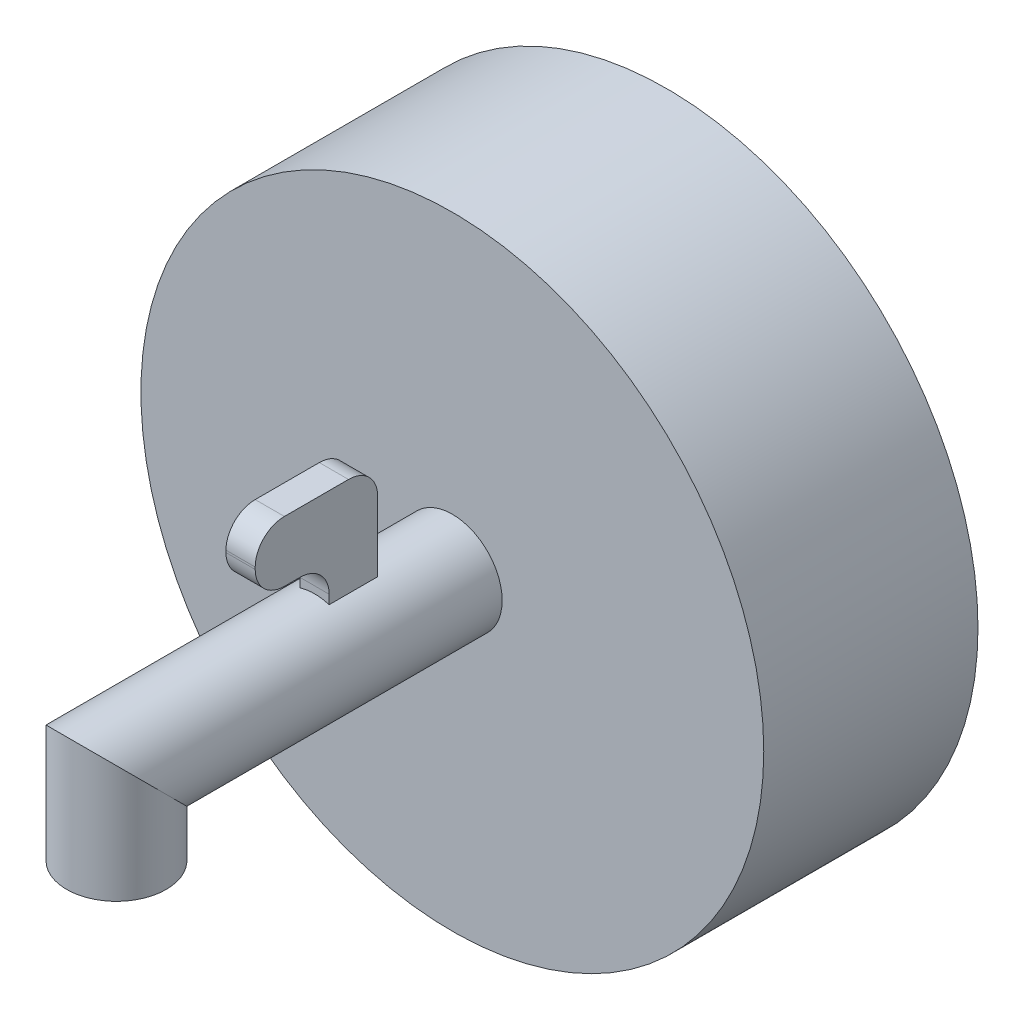
ISO-10303-21;
HEADER;
FILE_DESCRIPTION(('STEP AP214'),'2;1');
FILE_NAME('part.step','',(''),(''),'','','');
FILE_SCHEMA(('AUTOMOTIVE_DESIGN { 1 0 10303 214 1 1 1 1 }'));
ENDSEC;
DATA;
#1=APPLICATION_CONTEXT('core data for automotive mechanical design processes');
#2=APPLICATION_PROTOCOL_DEFINITION('international standard','automotive_design',2000,#1);
#3=PRODUCT_CONTEXT('',#1,'mechanical');
#4=PRODUCT('Part','Part','',(#3));
#5=PRODUCT_RELATED_PRODUCT_CATEGORY('part','',(#4));
#6=PRODUCT_DEFINITION_FORMATION('','',#4);
#7=PRODUCT_DEFINITION_CONTEXT('part definition',#1,'design');
#8=PRODUCT_DEFINITION('design','',#6,#7);
#9=PRODUCT_DEFINITION_SHAPE('','',#8);
#10=(LENGTH_UNIT() NAMED_UNIT(*) SI_UNIT(.MILLI.,.METRE.));
#11=(NAMED_UNIT(*) PLANE_ANGLE_UNIT() SI_UNIT($,.RADIAN.));
#12=(NAMED_UNIT(*) SI_UNIT($,.STERADIAN.) SOLID_ANGLE_UNIT());
#13=UNCERTAINTY_MEASURE_WITH_UNIT(LENGTH_MEASURE(1.E-05),#10,'distance_accuracy_value','');
#14=(GEOMETRIC_REPRESENTATION_CONTEXT(3) GLOBAL_UNCERTAINTY_ASSIGNED_CONTEXT((#13)) GLOBAL_UNIT_ASSIGNED_CONTEXT((#10,
#11,#12)) REPRESENTATION_CONTEXT('',''));
#15=CARTESIAN_POINT('',(0.,0.,0.));
#16=DIRECTION('',(0.,0.,1.));
#17=DIRECTION('',(1.,0.,0.));
#18=AXIS2_PLACEMENT_3D('',#15,#16,#17);
#19=CARTESIAN_POINT('',(0.,0.,22.));
#20=DIRECTION('',(0.,0.,1.));
#21=DIRECTION('',(1.,0.,0.));
#22=AXIS2_PLACEMENT_3D('',#19,#20,#21);
#23=CYLINDRICAL_SURFACE('',#22,5.11440394361429);
#24=CARTESIAN_POINT('',(0.,0.,22.));
#25=DIRECTION('',(0.,0.,1.));
#26=DIRECTION('',(1.,0.,0.));
#27=AXIS2_PLACEMENT_3D('',#24,#25,#26);
#28=CIRCLE('',#27,5.11440394361429);
#29=CARTESIAN_POINT('',(5.11440394361429,0.,22.));
#30=VERTEX_POINT('',#29);
#31=EDGE_CURVE('E191',#30,#30,#28,.T.);
#32=ORIENTED_EDGE('',*,*,#31,.T.);
#33=EDGE_LOOP('',(#32));
#34=FACE_BOUND('',#33,.T.);
#35=CARTESIAN_POINT('',(0.,0.,56.4961700363292));
#36=DIRECTION('',(0.,-0.707106781186547,0.707106781186547));
#37=DIRECTION('',(0.,0.707106781186548,0.707106781186548));
#38=AXIS2_PLACEMENT_3D('',#35,#36,#37);
#39=ELLIPSE('',#38,7.23285942051377,5.11440394361429);
#40=CARTESIAN_POINT('',(0.,5.11440394361429,61.6105739799435));
#41=VERTEX_POINT('',#40);
#42=EDGE_CURVE('E195',#41,#41,#39,.F.);
#43=ORIENTED_EDGE('',*,*,#42,.T.);
#44=EDGE_LOOP('',(#43));
#45=FACE_BOUND('',#44,.T.);
#46=CARTESIAN_POINT('',(0.,0.,36.1500922277302));
#47=DIRECTION('',(0.,0.,1.));
#48=DIRECTION('',(1.,0.,0.));
#49=AXIS2_PLACEMENT_3D('',#46,#47,#48);
#50=CIRCLE('',#49,5.11440394361429);
#51=CARTESIAN_POINT('',(-1.5,4.88949155827652,36.1500922277302));
#52=VERTEX_POINT('',#51);
#53=CARTESIAN_POINT('',(1.5,4.88949155827652,36.1500922277302));
#54=VERTEX_POINT('',#53);
#55=EDGE_CURVE('E45',#52,#54,#50,.F.);
#56=ORIENTED_EDGE('',*,*,#55,.F.);
#57=DIRECTION('',(0.,0.,1.));
#58=VECTOR('',#57,1.);
#59=CARTESIAN_POINT('',(-1.5,4.88949155827652,22.));
#60=LINE('',#59,#58);
#61=CARTESIAN_POINT('',(-1.5,4.88949155827652,31.1627336310282));
#62=VERTEX_POINT('',#61);
#63=EDGE_CURVE('E11',#52,#62,#60,.F.);
#64=ORIENTED_EDGE('',*,*,#63,.T.);
#65=CARTESIAN_POINT('',(0.,0.,31.1627336310282));
#66=DIRECTION('',(0.,0.,-1.));
#67=DIRECTION('',(-1.,0.,0.));
#68=AXIS2_PLACEMENT_3D('',#65,#66,#67);
#69=CIRCLE('',#68,5.11440394361429);
#70=CARTESIAN_POINT('',(1.5,4.88949155827652,31.1627336310282));
#71=VERTEX_POINT('',#70);
#72=EDGE_CURVE('E212',#71,#62,#69,.F.);
#73=ORIENTED_EDGE('',*,*,#72,.F.);
#74=DIRECTION('',(0.,0.,1.));
#75=VECTOR('',#74,1.);
#76=CARTESIAN_POINT('',(1.5,4.88949155827652,22.));
#77=LINE('',#76,#75);
#78=EDGE_CURVE('E118',#54,#71,#77,.F.);
#79=ORIENTED_EDGE('',*,*,#78,.F.);
#80=EDGE_LOOP('',(#56,#64,#73,#79));
#81=FACE_BOUND('',#80,.T.);
#82=ADVANCED_FACE('F37',(#34,#45,#81),#23,.T.);
#83=CARTESIAN_POINT('',(0.,0.,0.));
#84=DIRECTION('',(0.,0.,1.));
#85=DIRECTION('',(1.,0.,0.));
#86=AXIS2_PLACEMENT_3D('',#83,#84,#85);
#87=PLANE('',#86);
#88=CARTESIAN_POINT('',(0.,0.,0.));
#89=DIRECTION('',(0.,0.,1.));
#90=DIRECTION('',(1.,0.,0.));
#91=AXIS2_PLACEMENT_3D('',#88,#89,#90);
#92=CIRCLE('',#91,31.9808985232715);
#93=CARTESIAN_POINT('',(31.9808985232715,0.,0.));
#94=VERTEX_POINT('',#93);
#95=EDGE_CURVE('E194',#94,#94,#92,.T.);
#96=ORIENTED_EDGE('',*,*,#95,.F.);
#97=EDGE_LOOP('',(#96));
#98=FACE_BOUND('',#97,.T.);
#99=CARTESIAN_POINT('',(0.,0.,0.));
#100=DIRECTION('',(0.,0.,1.));
#101=DIRECTION('',(1.,0.,0.));
#102=AXIS2_PLACEMENT_3D('',#99,#100,#101);
#103=CIRCLE('',#102,25.45);
#104=CARTESIAN_POINT('',(25.45,0.,0.));
#105=VERTEX_POINT('',#104);
#106=EDGE_CURVE('E206',#105,#105,#103,.T.);
#107=ORIENTED_EDGE('',*,*,#106,.T.);
#108=EDGE_LOOP('',(#107));
#109=FACE_BOUND('',#108,.T.);
#110=ADVANCED_FACE('F251',(#98,#109),#87,.F.);
#111=CARTESIAN_POINT('',(0.,0.,20.));
#112=DIRECTION('',(0.,0.,-1.));
#113=DIRECTION('',(-1.,0.,0.));
#114=AXIS2_PLACEMENT_3D('',#111,#112,#113);
#115=CYLINDRICAL_SURFACE('',#114,31.9808985232715);
#116=ORIENTED_EDGE('',*,*,#95,.T.);
#117=EDGE_LOOP('',(#116));
#118=FACE_BOUND('',#117,.T.);
#119=CARTESIAN_POINT('',(0.,0.,22.));
#120=DIRECTION('',(0.,0.,1.));
#121=DIRECTION('',(1.,0.,0.));
#122=AXIS2_PLACEMENT_3D('',#119,#120,#121);
#123=CIRCLE('',#122,31.9808985232715);
#124=CARTESIAN_POINT('',(31.9808985232715,0.,22.));
#125=VERTEX_POINT('',#124);
#126=EDGE_CURVE('E198',#125,#125,#123,.T.);
#127=ORIENTED_EDGE('',*,*,#126,.F.);
#128=EDGE_LOOP('',(#127));
#129=FACE_BOUND('',#128,.T.);
#130=ADVANCED_FACE('F39',(#118,#129),#115,.T.);
#131=CARTESIAN_POINT('',(0.,0.,20.));
#132=DIRECTION('',(0.,0.,-1.));
#133=DIRECTION('',(-1.,0.,0.));
#134=AXIS2_PLACEMENT_3D('',#131,#132,#133);
#135=CYLINDRICAL_SURFACE('',#134,25.45);
#136=CARTESIAN_POINT('',(0.,0.,20.));
#137=DIRECTION('',(0.,0.,1.));
#138=DIRECTION('',(1.,0.,0.));
#139=AXIS2_PLACEMENT_3D('',#136,#137,#138);
#140=CIRCLE('',#139,25.45);
#141=CARTESIAN_POINT('',(25.45,0.,20.));
#142=VERTEX_POINT('',#141);
#143=EDGE_CURVE('E203',#142,#142,#140,.T.);
#144=ORIENTED_EDGE('',*,*,#143,.T.);
#145=EDGE_LOOP('',(#144));
#146=FACE_BOUND('',#145,.T.);
#147=ORIENTED_EDGE('',*,*,#106,.F.);
#148=EDGE_LOOP('',(#147));
#149=FACE_BOUND('',#148,.T.);
#150=ADVANCED_FACE('F277',(#146,#149),#135,.F.);
#151=CARTESIAN_POINT('',(0.,0.,20.));
#152=DIRECTION('',(0.,0.,1.));
#153=DIRECTION('',(1.,0.,0.));
#154=AXIS2_PLACEMENT_3D('',#151,#152,#153);
#155=PLANE('',#154);
#156=ORIENTED_EDGE('',*,*,#143,.F.);
#157=EDGE_LOOP('',(#156));
#158=FACE_BOUND('',#157,.T.);
#159=ADVANCED_FACE('F273',(#158),#155,.F.);
#160=CARTESIAN_POINT('',(0.,0.,22.));
#161=DIRECTION('',(0.,0.,1.));
#162=DIRECTION('',(1.,0.,0.));
#163=AXIS2_PLACEMENT_3D('',#160,#161,#162);
#164=PLANE('',#163);
#165=ORIENTED_EDGE('',*,*,#31,.F.);
#166=EDGE_LOOP('',(#165));
#167=FACE_BOUND('',#166,.T.);
#168=ORIENTED_EDGE('',*,*,#126,.T.);
#169=EDGE_LOOP('',(#168));
#170=FACE_BOUND('',#169,.T.);
#171=ADVANCED_FACE('F267',(#167,#170),#164,.T.);
#172=CARTESIAN_POINT('',(0.,-8.45463132273979,56.4961700363292));
#173=DIRECTION('',(0.,-1.,0.));
#174=DIRECTION('',(1.,0.,0.));
#175=AXIS2_PLACEMENT_3D('',#172,#173,#174);
#176=PLANE('',#175);
#177=CARTESIAN_POINT('',(0.,-8.45463132273979,56.4961700363292));
#178=DIRECTION('',(0.,-1.,0.));
#179=DIRECTION('',(1.,0.,0.));
#180=AXIS2_PLACEMENT_3D('',#177,#178,#179);
#181=CIRCLE('',#180,5.11440394361429);
#182=CARTESIAN_POINT('',(5.11440394361429,-8.45463132273979,56.4961700363292));
#183=VERTEX_POINT('',#182);
#184=EDGE_CURVE('E179',#183,#183,#181,.T.);
#185=ORIENTED_EDGE('',*,*,#184,.T.);
#186=EDGE_LOOP('',(#185));
#187=FACE_BOUND('',#186,.T.);
#188=ADVANCED_FACE('F265',(#187),#176,.T.);
#189=CARTESIAN_POINT('',(0.,11.3516886759514,56.4961700363292));
#190=DIRECTION('',(0.,-1.,0.));
#191=DIRECTION('',(0.,0.,-1.));
#192=AXIS2_PLACEMENT_3D('',#189,#190,#191);
#193=CYLINDRICAL_SURFACE('',#192,5.11440394361429);
#194=ORIENTED_EDGE('',*,*,#42,.F.);
#195=EDGE_LOOP('',(#194));
#196=FACE_BOUND('',#195,.T.);
#197=ORIENTED_EDGE('',*,*,#184,.F.);
#198=EDGE_LOOP('',(#197));
#199=FACE_BOUND('',#198,.T.);
#200=ADVANCED_FACE('F262',(#196,#199),#193,.T.);
#201=CARTESIAN_POINT('',(-1.5,0.,36.1500922277302));
#202=DIRECTION('',(0.,0.,1.));
#203=DIRECTION('',(1.,0.,0.));
#204=AXIS2_PLACEMENT_3D('',#201,#202,#203);
#205=PLANE('',#204);
#206=DIRECTION('',(0.,-1.,0.));
#207=VECTOR('',#206,1.);
#208=CARTESIAN_POINT('',(-1.5,0.,36.1500922277302));
#209=LINE('',#208,#207);
#210=CARTESIAN_POINT('',(-1.5,5.82378828647278,36.1500922277302));
#211=VERTEX_POINT('',#210);
#212=EDGE_CURVE('E130',#211,#52,#209,.T.);
#213=ORIENTED_EDGE('',*,*,#212,.T.);
#214=ORIENTED_EDGE('',*,*,#55,.T.);
#215=DIRECTION('',(0.,-1.,0.));
#216=VECTOR('',#215,1.);
#217=CARTESIAN_POINT('',(1.5,0.,36.1500922277302));
#218=LINE('',#217,#216);
#219=CARTESIAN_POINT('',(1.5,5.82378828647278,36.1500922277302));
#220=VERTEX_POINT('',#219);
#221=EDGE_CURVE('E152',#220,#54,#218,.T.);
#222=ORIENTED_EDGE('',*,*,#221,.F.);
#223=DIRECTION('',(1.,0.,0.));
#224=VECTOR('',#223,1.);
#225=CARTESIAN_POINT('',(-1.5,5.82378828647278,36.1500922277302));
#226=LINE('',#225,#224);
#227=EDGE_CURVE('E177',#211,#220,#226,.T.);
#228=ORIENTED_EDGE('',*,*,#227,.F.);
#229=EDGE_LOOP('',(#213,#214,#222,#228));
#230=FACE_BOUND('',#229,.T.);
#231=ADVANCED_FACE('F215',(#230),#205,.T.);
#232=CARTESIAN_POINT('',(-1.5,5.82378828647278,39.1500922277302));
#233=DIRECTION('',(1.,0.,0.));
#234=DIRECTION('',(0.,0.,-1.));
#235=AXIS2_PLACEMENT_3D('',#232,#233,#234);
#236=CYLINDRICAL_SURFACE('',#235,3.);
#237=ORIENTED_EDGE('',*,*,#227,.T.);
#238=CARTESIAN_POINT('',(1.5,5.82378828647278,39.1500922277302));
#239=DIRECTION('',(-1.,0.,0.));
#240=DIRECTION('',(0.,0.,-1.));
#241=AXIS2_PLACEMENT_3D('',#238,#239,#240);
#242=CIRCLE('',#241,3.);
#243=CARTESIAN_POINT('',(1.5,8.82378828647279,39.1500922277302));
#244=VERTEX_POINT('',#243);
#245=EDGE_CURVE('E149',#244,#220,#242,.T.);
#246=ORIENTED_EDGE('',*,*,#245,.F.);
#247=DIRECTION('',(1.,0.,0.));
#248=VECTOR('',#247,1.);
#249=CARTESIAN_POINT('',(-1.5,8.82378828647279,39.1500922277302));
#250=LINE('',#249,#248);
#251=CARTESIAN_POINT('',(-1.5,8.82378828647279,39.1500922277302));
#252=VERTEX_POINT('',#251);
#253=EDGE_CURVE('E180',#252,#244,#250,.T.);
#254=ORIENTED_EDGE('',*,*,#253,.F.);
#255=CARTESIAN_POINT('',(-1.5,5.82378828647278,39.1500922277302));
#256=DIRECTION('',(-1.,0.,0.));
#257=DIRECTION('',(0.,0.,-1.));
#258=AXIS2_PLACEMENT_3D('',#255,#256,#257);
#259=CIRCLE('',#258,3.);
#260=EDGE_CURVE('E172',#252,#211,#259,.T.);
#261=ORIENTED_EDGE('',*,*,#260,.T.);
#262=EDGE_LOOP('',(#237,#246,#254,#261));
#263=FACE_BOUND('',#262,.T.);
#264=ADVANCED_FACE('F220',(#263),#236,.F.);
#265=CARTESIAN_POINT('',(-1.5,8.82378828647278,39.1500922277302));
#266=DIRECTION('',(0.,-1.,0.));
#267=DIRECTION('',(0.,0.,-1.));
#268=AXIS2_PLACEMENT_3D('',#265,#266,#267);
#269=PLANE('',#268);
#270=ORIENTED_EDGE('',*,*,#253,.T.);
#271=DIRECTION('',(0.,0.,-1.));
#272=VECTOR('',#271,1.);
#273=CARTESIAN_POINT('',(1.5,8.82378828647278,39.1500922277302));
#274=LINE('',#273,#272);
#275=CARTESIAN_POINT('',(1.5,8.82378828647278,40.7462230134764));
#276=VERTEX_POINT('',#275);
#277=EDGE_CURVE('E146',#276,#244,#274,.T.);
#278=ORIENTED_EDGE('',*,*,#277,.F.);
#279=DIRECTION('',(1.,0.,0.));
#280=VECTOR('',#279,1.);
#281=CARTESIAN_POINT('',(-1.5,8.82378828647278,40.7462230134764));
#282=LINE('',#281,#280);
#283=CARTESIAN_POINT('',(-1.5,8.82378828647278,40.7462230134764));
#284=VERTEX_POINT('',#283);
#285=EDGE_CURVE('E182',#284,#276,#282,.T.);
#286=ORIENTED_EDGE('',*,*,#285,.F.);
#287=DIRECTION('',(0.,0.,-1.));
#288=VECTOR('',#287,1.);
#289=CARTESIAN_POINT('',(-1.5,8.82378828647278,39.1500922277302));
#290=LINE('',#289,#288);
#291=EDGE_CURVE('E169',#284,#252,#290,.T.);
#292=ORIENTED_EDGE('',*,*,#291,.T.);
#293=EDGE_LOOP('',(#270,#278,#286,#292));
#294=FACE_BOUND('',#293,.T.);
#295=ADVANCED_FACE('F241',(#294),#269,.T.);
#296=CARTESIAN_POINT('',(-1.5,11.8237882864728,40.7462230134764));
#297=DIRECTION('',(1.,0.,0.));
#298=DIRECTION('',(0.,0.,-1.));
#299=AXIS2_PLACEMENT_3D('',#296,#297,#298);
#300=CYLINDRICAL_SURFACE('',#299,3.);
#301=ORIENTED_EDGE('',*,*,#285,.T.);
#302=CARTESIAN_POINT('',(1.5,11.8237882864728,40.7462230134764));
#303=DIRECTION('',(1.,0.,0.));
#304=DIRECTION('',(0.,0.,1.));
#305=AXIS2_PLACEMENT_3D('',#302,#303,#304);
#306=CIRCLE('',#305,3.);
#307=CARTESIAN_POINT('',(1.5,11.8237882864728,43.7462230134764));
#308=VERTEX_POINT('',#307);
#309=EDGE_CURVE('E143',#308,#276,#306,.T.);
#310=ORIENTED_EDGE('',*,*,#309,.F.);
#311=DIRECTION('',(1.,0.,0.));
#312=VECTOR('',#311,1.);
#313=CARTESIAN_POINT('',(-1.5,11.8237882864728,43.7462230134764));
#314=LINE('',#313,#312);
#315=CARTESIAN_POINT('',(-1.5,11.8237882864728,43.7462230134764));
#316=VERTEX_POINT('',#315);
#317=EDGE_CURVE('E184',#316,#308,#314,.T.);
#318=ORIENTED_EDGE('',*,*,#317,.F.);
#319=CARTESIAN_POINT('',(-1.5,11.8237882864728,40.7462230134764));
#320=DIRECTION('',(1.,0.,0.));
#321=DIRECTION('',(0.,0.,1.));
#322=AXIS2_PLACEMENT_3D('',#319,#320,#321);
#323=CIRCLE('',#322,3.);
#324=EDGE_CURVE('E166',#316,#284,#323,.T.);
#325=ORIENTED_EDGE('',*,*,#324,.T.);
#326=EDGE_LOOP('',(#301,#310,#318,#325));
#327=FACE_BOUND('',#326,.T.);
#328=ADVANCED_FACE('F238',(#327),#300,.T.);
#329=CARTESIAN_POINT('',(-1.5,11.8237882864728,43.7462230134764));
#330=DIRECTION('',(0.,0.,1.));
#331=DIRECTION('',(1.,0.,0.));
#332=AXIS2_PLACEMENT_3D('',#329,#330,#331);
#333=PLANE('',#332);
#334=ORIENTED_EDGE('',*,*,#317,.T.);
#335=DIRECTION('',(0.,-1.,0.));
#336=VECTOR('',#335,1.);
#337=CARTESIAN_POINT('',(1.5,11.8237882864728,43.7462230134764));
#338=LINE('',#337,#336);
#339=CARTESIAN_POINT('',(1.5,12.0388043839014,43.7462230134764));
#340=VERTEX_POINT('',#339);
#341=EDGE_CURVE('E140',#340,#308,#338,.T.);
#342=ORIENTED_EDGE('',*,*,#341,.F.);
#343=DIRECTION('',(1.,0.,0.));
#344=VECTOR('',#343,1.);
#345=CARTESIAN_POINT('',(-1.5,12.0388043839014,43.7462230134764));
#346=LINE('',#345,#344);
#347=CARTESIAN_POINT('',(-1.5,12.0388043839014,43.7462230134764));
#348=VERTEX_POINT('',#347);
#349=EDGE_CURVE('E186',#348,#340,#346,.T.);
#350=ORIENTED_EDGE('',*,*,#349,.F.);
#351=DIRECTION('',(0.,-1.,0.));
#352=VECTOR('',#351,1.);
#353=CARTESIAN_POINT('',(-1.5,11.8237882864728,43.7462230134764));
#354=LINE('',#353,#352);
#355=EDGE_CURVE('E163',#348,#316,#354,.T.);
#356=ORIENTED_EDGE('',*,*,#355,.T.);
#357=EDGE_LOOP('',(#334,#342,#350,#356));
#358=FACE_BOUND('',#357,.T.);
#359=ADVANCED_FACE('F235',(#358),#333,.T.);
#360=CARTESIAN_POINT('',(-1.5,12.0388043839015,40.7462230134764));
#361=DIRECTION('',(1.,0.,0.));
#362=DIRECTION('',(0.,0.,-1.));
#363=AXIS2_PLACEMENT_3D('',#360,#361,#362);
#364=CYLINDRICAL_SURFACE('',#363,3.);
#365=ORIENTED_EDGE('',*,*,#349,.T.);
#366=CARTESIAN_POINT('',(1.5,12.0388043839015,40.7462230134764));
#367=DIRECTION('',(1.,0.,0.));
#368=DIRECTION('',(0.,0.,1.));
#369=AXIS2_PLACEMENT_3D('',#366,#367,#368);
#370=CIRCLE('',#369,3.);
#371=CARTESIAN_POINT('',(1.5,15.0388043839015,40.7462230134764));
#372=VERTEX_POINT('',#371);
#373=EDGE_CURVE('E135',#372,#340,#370,.T.);
#374=ORIENTED_EDGE('',*,*,#373,.F.);
#375=DIRECTION('',(1.,0.,0.));
#376=VECTOR('',#375,1.);
#377=CARTESIAN_POINT('',(-1.5,15.0388043839015,40.7462230134764));
#378=LINE('',#377,#376);
#379=CARTESIAN_POINT('',(-1.5,15.0388043839015,40.7462230134764));
#380=VERTEX_POINT('',#379);
#381=EDGE_CURVE('E188',#380,#372,#378,.T.);
#382=ORIENTED_EDGE('',*,*,#381,.F.);
#383=CARTESIAN_POINT('',(-1.5,12.0388043839015,40.7462230134764));
#384=DIRECTION('',(1.,0.,0.));
#385=DIRECTION('',(0.,0.,1.));
#386=AXIS2_PLACEMENT_3D('',#383,#384,#385);
#387=CIRCLE('',#386,3.);
#388=EDGE_CURVE('E160',#380,#348,#387,.T.);
#389=ORIENTED_EDGE('',*,*,#388,.T.);
#390=EDGE_LOOP('',(#365,#374,#382,#389));
#391=FACE_BOUND('',#390,.T.);
#392=ADVANCED_FACE('F233',(#391),#364,.T.);
#393=CARTESIAN_POINT('',(-1.5,15.0388043839015,40.7462230134764));
#394=DIRECTION('',(0.,1.,0.));
#395=DIRECTION('',(0.,0.,1.));
#396=AXIS2_PLACEMENT_3D('',#393,#394,#395);
#397=PLANE('',#396);
#398=ORIENTED_EDGE('',*,*,#381,.T.);
#399=DIRECTION('',(0.,0.,1.));
#400=VECTOR('',#399,1.);
#401=CARTESIAN_POINT('',(1.5,15.0388043839015,40.7462230134764));
#402=LINE('',#401,#400);
#403=CARTESIAN_POINT('',(1.5,15.0388043839015,34.1627336310282));
#404=VERTEX_POINT('',#403);
#405=EDGE_CURVE('E133',#404,#372,#402,.T.);
#406=ORIENTED_EDGE('',*,*,#405,.F.);
#407=DIRECTION('',(1.,0.,0.));
#408=VECTOR('',#407,1.);
#409=CARTESIAN_POINT('',(-1.5,15.0388043839015,34.1627336310282));
#410=LINE('',#409,#408);
#411=CARTESIAN_POINT('',(-1.5,15.0388043839015,34.1627336310282));
#412=VERTEX_POINT('',#411);
#413=EDGE_CURVE('E129',#412,#404,#410,.T.);
#414=ORIENTED_EDGE('',*,*,#413,.F.);
#415=DIRECTION('',(0.,0.,1.));
#416=VECTOR('',#415,1.);
#417=CARTESIAN_POINT('',(-1.5,15.0388043839015,40.7462230134764));
#418=LINE('',#417,#416);
#419=EDGE_CURVE('E157',#412,#380,#418,.T.);
#420=ORIENTED_EDGE('',*,*,#419,.T.);
#421=EDGE_LOOP('',(#398,#406,#414,#420));
#422=FACE_BOUND('',#421,.T.);
#423=ADVANCED_FACE('F229',(#422),#397,.T.);
#424=CARTESIAN_POINT('',(-1.5,12.0388043839015,34.1627336310282));
#425=DIRECTION('',(1.,0.,0.));
#426=DIRECTION('',(0.,0.,-1.));
#427=AXIS2_PLACEMENT_3D('',#424,#425,#426);
#428=CYLINDRICAL_SURFACE('',#427,3.);
#429=ORIENTED_EDGE('',*,*,#413,.T.);
#430=CARTESIAN_POINT('',(1.5,12.0388043839015,34.1627336310282));
#431=DIRECTION('',(1.,0.,0.));
#432=DIRECTION('',(0.,0.,1.));
#433=AXIS2_PLACEMENT_3D('',#430,#431,#432);
#434=CIRCLE('',#433,3.);
#435=CARTESIAN_POINT('',(1.5,12.0388043839014,31.1627336310282));
#436=VERTEX_POINT('',#435);
#437=EDGE_CURVE('E116',#436,#404,#434,.T.);
#438=ORIENTED_EDGE('',*,*,#437,.F.);
#439=DIRECTION('',(1.,0.,0.));
#440=VECTOR('',#439,1.);
#441=CARTESIAN_POINT('',(-1.5,12.0388043839014,31.1627336310282));
#442=LINE('',#441,#440);
#443=CARTESIAN_POINT('',(-1.5,12.0388043839014,31.1627336310282));
#444=VERTEX_POINT('',#443);
#445=EDGE_CURVE('E122',#444,#436,#442,.T.);
#446=ORIENTED_EDGE('',*,*,#445,.F.);
#447=CARTESIAN_POINT('',(-1.5,12.0388043839015,34.1627336310282));
#448=DIRECTION('',(1.,0.,0.));
#449=DIRECTION('',(0.,0.,1.));
#450=AXIS2_PLACEMENT_3D('',#447,#448,#449);
#451=CIRCLE('',#450,3.);
#452=EDGE_CURVE('E155',#444,#412,#451,.T.);
#453=ORIENTED_EDGE('',*,*,#452,.T.);
#454=EDGE_LOOP('',(#429,#438,#446,#453));
#455=FACE_BOUND('',#454,.T.);
#456=ADVANCED_FACE('F132',(#455),#428,.T.);
#457=CARTESIAN_POINT('',(-1.5,12.0388043839014,31.1627336310282));
#458=DIRECTION('',(0.,0.,-1.));
#459=DIRECTION('',(-1.,0.,0.));
#460=AXIS2_PLACEMENT_3D('',#457,#458,#459);
#461=PLANE('',#460);
#462=DIRECTION('',(0.,1.,0.));
#463=VECTOR('',#462,1.);
#464=CARTESIAN_POINT('',(1.5,12.0388043839014,31.1627336310282));
#465=LINE('',#464,#463);
#466=EDGE_CURVE('E110',#71,#436,#465,.T.);
#467=ORIENTED_EDGE('',*,*,#466,.F.);
#468=ORIENTED_EDGE('',*,*,#72,.T.);
#469=DIRECTION('',(0.,1.,0.));
#470=VECTOR('',#469,1.);
#471=CARTESIAN_POINT('',(-1.5,12.0388043839014,31.1627336310282));
#472=LINE('',#471,#470);
#473=EDGE_CURVE('E125',#62,#444,#472,.T.);
#474=ORIENTED_EDGE('',*,*,#473,.T.);
#475=ORIENTED_EDGE('',*,*,#445,.T.);
#476=EDGE_LOOP('',(#467,#468,#474,#475));
#477=FACE_BOUND('',#476,.T.);
#478=ADVANCED_FACE('F123',(#477),#461,.T.);
#479=CARTESIAN_POINT('',(-1.5,5.82378828647278,39.1500922277302));
#480=DIRECTION('',(1.,0.,0.));
#481=DIRECTION('',(0.,0.,-1.));
#482=AXIS2_PLACEMENT_3D('',#479,#480,#481);
#483=PLANE('',#482);
#484=ORIENTED_EDGE('',*,*,#63,.F.);
#485=ORIENTED_EDGE('',*,*,#212,.F.);
#486=ORIENTED_EDGE('',*,*,#260,.F.);
#487=ORIENTED_EDGE('',*,*,#291,.F.);
#488=ORIENTED_EDGE('',*,*,#324,.F.);
#489=ORIENTED_EDGE('',*,*,#355,.F.);
#490=ORIENTED_EDGE('',*,*,#388,.F.);
#491=ORIENTED_EDGE('',*,*,#419,.F.);
#492=ORIENTED_EDGE('',*,*,#452,.F.);
#493=ORIENTED_EDGE('',*,*,#473,.F.);
#494=EDGE_LOOP('',(#484,#485,#486,#487,#488,#489,#490,#491,#492,#493));
#495=FACE_BOUND('',#494,.T.);
#496=ADVANCED_FACE('F224',(#495),#483,.F.);
#497=CARTESIAN_POINT('',(1.5,5.82378828647278,39.1500922277302));
#498=DIRECTION('',(1.,0.,0.));
#499=DIRECTION('',(0.,0.,-1.));
#500=AXIS2_PLACEMENT_3D('',#497,#498,#499);
#501=PLANE('',#500);
#502=ORIENTED_EDGE('',*,*,#221,.T.);
#503=ORIENTED_EDGE('',*,*,#78,.T.);
#504=ORIENTED_EDGE('',*,*,#466,.T.);
#505=ORIENTED_EDGE('',*,*,#437,.T.);
#506=ORIENTED_EDGE('',*,*,#405,.T.);
#507=ORIENTED_EDGE('',*,*,#373,.T.);
#508=ORIENTED_EDGE('',*,*,#341,.T.);
#509=ORIENTED_EDGE('',*,*,#309,.T.);
#510=ORIENTED_EDGE('',*,*,#277,.T.);
#511=ORIENTED_EDGE('',*,*,#245,.T.);
#512=EDGE_LOOP('',(#502,#503,#504,#505,#506,#507,#508,#509,#510,#511));
#513=FACE_BOUND('',#512,.T.);
#514=ADVANCED_FACE('F113',(#513),#501,.T.);
#515=CLOSED_SHELL('',(#82,#110,#130,#150,#159,#171,#188,#200,#231,#264,#295,#328,#359,#392,#423,
#456,#478,#496,#514));
#516=MANIFOLD_SOLID_BREP('B2',#515);
#517=ADVANCED_BREP_SHAPE_REPRESENTATION('',(#18,#516),#14);
#518=SHAPE_DEFINITION_REPRESENTATION(#9,#517);
ENDSEC;
END-ISO-10303-21;
